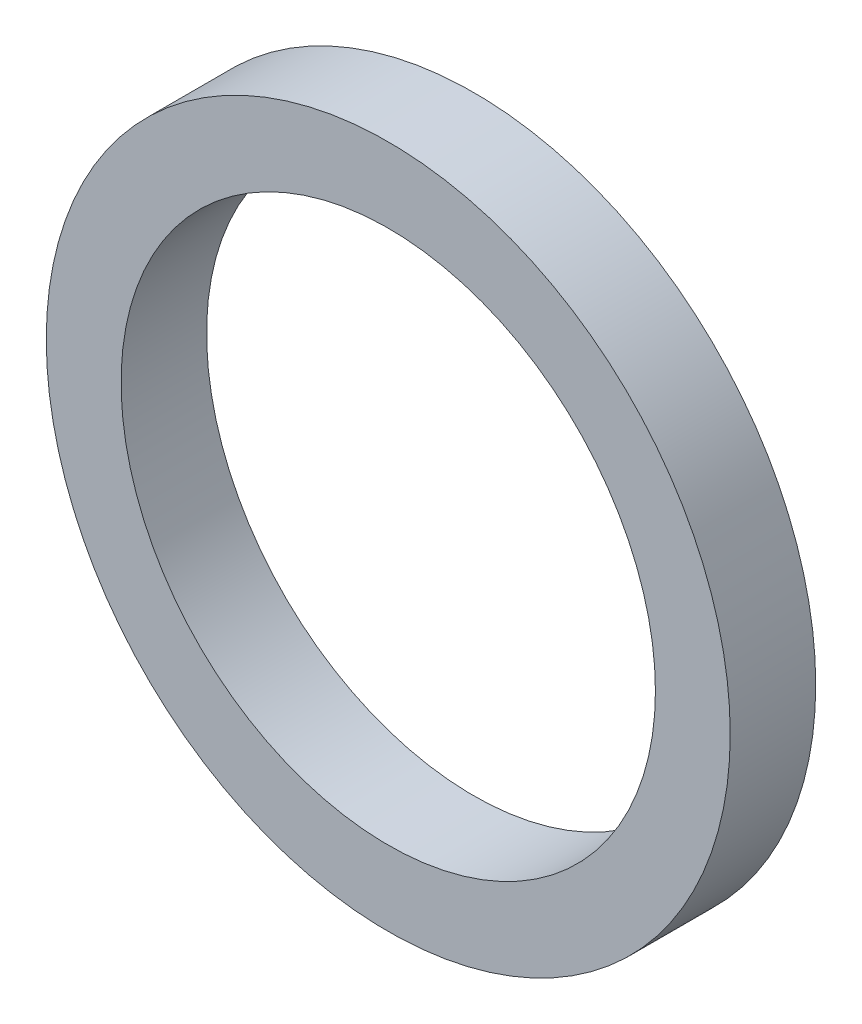
ISO-10303-21;
HEADER;
FILE_DESCRIPTION(('STEP AP214'),'2;1');
FILE_NAME('part.step','',(''),(''),'','','');
FILE_SCHEMA(('AUTOMOTIVE_DESIGN { 1 0 10303 214 1 1 1 1 }'));
ENDSEC;
DATA;
#1=APPLICATION_CONTEXT('core data for automotive mechanical design processes');
#2=APPLICATION_PROTOCOL_DEFINITION('international standard','automotive_design',2000,#1);
#3=PRODUCT_CONTEXT('',#1,'mechanical');
#4=PRODUCT('Part','Part','',(#3));
#5=PRODUCT_RELATED_PRODUCT_CATEGORY('part','',(#4));
#6=PRODUCT_DEFINITION_FORMATION('','',#4);
#7=PRODUCT_DEFINITION_CONTEXT('part definition',#1,'design');
#8=PRODUCT_DEFINITION('design','',#6,#7);
#9=PRODUCT_DEFINITION_SHAPE('','',#8);
#10=(LENGTH_UNIT() NAMED_UNIT(*) SI_UNIT(.MILLI.,.METRE.));
#11=(NAMED_UNIT(*) PLANE_ANGLE_UNIT() SI_UNIT($,.RADIAN.));
#12=(NAMED_UNIT(*) SI_UNIT($,.STERADIAN.) SOLID_ANGLE_UNIT());
#13=UNCERTAINTY_MEASURE_WITH_UNIT(LENGTH_MEASURE(1.E-05),#10,'distance_accuracy_value','');
#14=(GEOMETRIC_REPRESENTATION_CONTEXT(3) GLOBAL_UNCERTAINTY_ASSIGNED_CONTEXT((#13)) GLOBAL_UNIT_ASSIGNED_CONTEXT((#10,
#11,#12)) REPRESENTATION_CONTEXT('',''));
#15=CARTESIAN_POINT('',(0.,0.,0.));
#16=DIRECTION('',(0.,0.,1.));
#17=DIRECTION('',(1.,0.,0.));
#18=AXIS2_PLACEMENT_3D('',#15,#16,#17);
#19=CARTESIAN_POINT('',(0.,0.,4.));
#20=DIRECTION('',(0.,0.,1.));
#21=DIRECTION('',(1.,0.,0.));
#22=AXIS2_PLACEMENT_3D('',#19,#20,#21);
#23=PLANE('',#22);
#24=CARTESIAN_POINT('',(0.,0.,4.));
#25=DIRECTION('',(0.,0.,1.));
#26=DIRECTION('',(1.,0.,0.));
#27=AXIS2_PLACEMENT_3D('',#24,#25,#26);
#28=CIRCLE('',#27,16.);
#29=CARTESIAN_POINT('',(16.,0.,4.));
#30=VERTEX_POINT('',#29);
#31=EDGE_CURVE('E10',#30,#30,#28,.T.);
#32=ORIENTED_EDGE('',*,*,#31,.T.);
#33=EDGE_LOOP('',(#32));
#34=FACE_BOUND('',#33,.T.);
#35=CARTESIAN_POINT('',(0.,0.,4.));
#36=DIRECTION('',(0.,0.,1.));
#37=DIRECTION('',(1.,0.,0.));
#38=AXIS2_PLACEMENT_3D('',#35,#36,#37);
#39=CIRCLE('',#38,12.5);
#40=CARTESIAN_POINT('',(12.5,0.,4.));
#41=VERTEX_POINT('',#40);
#42=EDGE_CURVE('E43',#41,#41,#39,.T.);
#43=ORIENTED_EDGE('',*,*,#42,.F.);
#44=EDGE_LOOP('',(#43));
#45=FACE_BOUND('',#44,.T.);
#46=ADVANCED_FACE('F32',(#34,#45),#23,.T.);
#47=CARTESIAN_POINT('',(0.,0.,0.));
#48=DIRECTION('',(0.,0.,1.));
#49=DIRECTION('',(1.,0.,0.));
#50=AXIS2_PLACEMENT_3D('',#47,#48,#49);
#51=PLANE('',#50);
#52=CARTESIAN_POINT('',(0.,0.,0.));
#53=DIRECTION('',(0.,0.,1.));
#54=DIRECTION('',(1.,0.,0.));
#55=AXIS2_PLACEMENT_3D('',#52,#53,#54);
#56=CIRCLE('',#55,16.);
#57=CARTESIAN_POINT('',(16.,0.,0.));
#58=VERTEX_POINT('',#57);
#59=EDGE_CURVE('E36',#58,#58,#56,.T.);
#60=ORIENTED_EDGE('',*,*,#59,.F.);
#61=EDGE_LOOP('',(#60));
#62=FACE_BOUND('',#61,.T.);
#63=CARTESIAN_POINT('',(0.,0.,0.));
#64=DIRECTION('',(0.,0.,1.));
#65=DIRECTION('',(1.,0.,0.));
#66=AXIS2_PLACEMENT_3D('',#63,#64,#65);
#67=CIRCLE('',#66,12.5);
#68=CARTESIAN_POINT('',(12.5,0.,0.));
#69=VERTEX_POINT('',#68);
#70=EDGE_CURVE('E45',#69,#69,#67,.T.);
#71=ORIENTED_EDGE('',*,*,#70,.T.);
#72=EDGE_LOOP('',(#71));
#73=FACE_BOUND('',#72,.T.);
#74=ADVANCED_FACE('F55',(#62,#73),#51,.F.);
#75=CARTESIAN_POINT('',(0.,0.,4.));
#76=DIRECTION('',(0.,0.,-1.));
#77=DIRECTION('',(-1.,0.,0.));
#78=AXIS2_PLACEMENT_3D('',#75,#76,#77);
#79=CYLINDRICAL_SURFACE('',#78,16.);
#80=ORIENTED_EDGE('',*,*,#31,.F.);
#81=EDGE_LOOP('',(#80));
#82=FACE_BOUND('',#81,.T.);
#83=ORIENTED_EDGE('',*,*,#59,.T.);
#84=EDGE_LOOP('',(#83));
#85=FACE_BOUND('',#84,.T.);
#86=ADVANCED_FACE('F34',(#82,#85),#79,.T.);
#87=CARTESIAN_POINT('',(0.,0.,4.));
#88=DIRECTION('',(0.,0.,-1.));
#89=DIRECTION('',(-1.,0.,0.));
#90=AXIS2_PLACEMENT_3D('',#87,#88,#89);
#91=CYLINDRICAL_SURFACE('',#90,12.5);
#92=ORIENTED_EDGE('',*,*,#42,.T.);
#93=EDGE_LOOP('',(#92));
#94=FACE_BOUND('',#93,.T.);
#95=ORIENTED_EDGE('',*,*,#70,.F.);
#96=EDGE_LOOP('',(#95));
#97=FACE_BOUND('',#96,.T.);
#98=ADVANCED_FACE('F51',(#94,#97),#91,.F.);
#99=CLOSED_SHELL('',(#46,#74,#86,#98));
#100=MANIFOLD_SOLID_BREP('B2',#99);
#101=ADVANCED_BREP_SHAPE_REPRESENTATION('',(#18,#100),#14);
#102=SHAPE_DEFINITION_REPRESENTATION(#9,#101);
ENDSEC;
END-ISO-10303-21;
